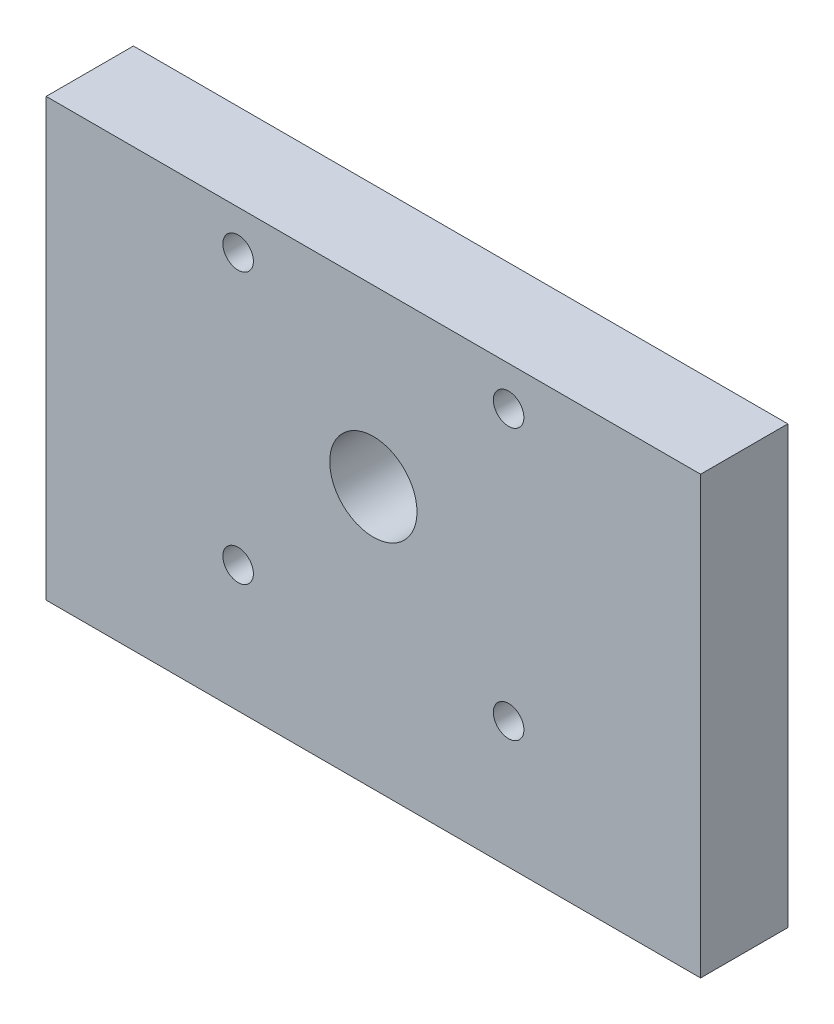
ISO-10303-21;
HEADER;
FILE_DESCRIPTION(('STEP AP214'),'2;1');
FILE_NAME('part.step','',(''),(''),'','','');
FILE_SCHEMA(('AUTOMOTIVE_DESIGN { 1 0 10303 214 1 1 1 1 }'));
ENDSEC;
DATA;
#1=APPLICATION_CONTEXT('core data for automotive mechanical design processes');
#2=APPLICATION_PROTOCOL_DEFINITION('international standard','automotive_design',2000,#1);
#3=PRODUCT_CONTEXT('',#1,'mechanical');
#4=PRODUCT('Part','Part','',(#3));
#5=PRODUCT_RELATED_PRODUCT_CATEGORY('part','',(#4));
#6=PRODUCT_DEFINITION_FORMATION('','',#4);
#7=PRODUCT_DEFINITION_CONTEXT('part definition',#1,'design');
#8=PRODUCT_DEFINITION('design','',#6,#7);
#9=PRODUCT_DEFINITION_SHAPE('','',#8);
#10=(LENGTH_UNIT() NAMED_UNIT(*) SI_UNIT(.MILLI.,.METRE.));
#11=(NAMED_UNIT(*) PLANE_ANGLE_UNIT() SI_UNIT($,.RADIAN.));
#12=(NAMED_UNIT(*) SI_UNIT($,.STERADIAN.) SOLID_ANGLE_UNIT());
#13=UNCERTAINTY_MEASURE_WITH_UNIT(LENGTH_MEASURE(1.E-05),#10,'distance_accuracy_value','');
#14=(GEOMETRIC_REPRESENTATION_CONTEXT(3) GLOBAL_UNCERTAINTY_ASSIGNED_CONTEXT((#13)) GLOBAL_UNIT_ASSIGNED_CONTEXT((#10,
#11,#12)) REPRESENTATION_CONTEXT('',''));
#15=CARTESIAN_POINT('',(0.,0.,0.));
#16=DIRECTION('',(0.,0.,1.));
#17=DIRECTION('',(1.,0.,0.));
#18=AXIS2_PLACEMENT_3D('',#15,#16,#17);
#19=CARTESIAN_POINT('',(0.,0.,10.));
#20=DIRECTION('',(0.,0.,-1.));
#21=DIRECTION('',(-1.,0.,0.));
#22=AXIS2_PLACEMENT_3D('',#19,#20,#21);
#23=PLANE('',#22);
#24=CARTESIAN_POINT('',(-15.5,15.4999999999998,10.));
#25=DIRECTION('',(0.,0.,-1.));
#26=DIRECTION('',(-1.,0.,0.));
#27=AXIS2_PLACEMENT_3D('',#24,#25,#26);
#28=CIRCLE('',#27,1.75);
#29=CARTESIAN_POINT('',(-17.25,15.4999999999998,10.));
#30=VERTEX_POINT('',#29);
#31=EDGE_CURVE('E109',#30,#30,#28,.T.);
#32=ORIENTED_EDGE('',*,*,#31,.T.);
#33=EDGE_LOOP('',(#32));
#34=FACE_BOUND('',#33,.T.);
#35=CARTESIAN_POINT('',(15.5,15.5000000000001,10.));
#36=DIRECTION('',(0.,0.,-1.));
#37=DIRECTION('',(-1.,0.,0.));
#38=AXIS2_PLACEMENT_3D('',#35,#36,#37);
#39=CIRCLE('',#38,1.75);
#40=CARTESIAN_POINT('',(13.75,15.5000000000001,10.));
#41=VERTEX_POINT('',#40);
#42=EDGE_CURVE('E115',#41,#41,#39,.T.);
#43=ORIENTED_EDGE('',*,*,#42,.T.);
#44=EDGE_LOOP('',(#43));
#45=FACE_BOUND('',#44,.T.);
#46=CARTESIAN_POINT('',(15.5000000000001,-15.4999999999999,10.));
#47=DIRECTION('',(0.,0.,-1.));
#48=DIRECTION('',(-1.,0.,0.));
#49=AXIS2_PLACEMENT_3D('',#46,#47,#48);
#50=CIRCLE('',#49,1.75);
#51=CARTESIAN_POINT('',(13.7500000000001,-15.4999999999999,10.));
#52=VERTEX_POINT('',#51);
#53=EDGE_CURVE('E121',#52,#52,#50,.T.);
#54=ORIENTED_EDGE('',*,*,#53,.T.);
#55=EDGE_LOOP('',(#54));
#56=FACE_BOUND('',#55,.T.);
#57=CARTESIAN_POINT('',(-15.4999999999999,-15.5,10.));
#58=DIRECTION('',(0.,0.,-1.));
#59=DIRECTION('',(-1.,0.,0.));
#60=AXIS2_PLACEMENT_3D('',#57,#58,#59);
#61=CIRCLE('',#60,1.75);
#62=CARTESIAN_POINT('',(-17.2499999999999,-15.5,10.));
#63=VERTEX_POINT('',#62);
#64=EDGE_CURVE('E127',#63,#63,#61,.T.);
#65=ORIENTED_EDGE('',*,*,#64,.T.);
#66=EDGE_LOOP('',(#65));
#67=FACE_BOUND('',#66,.T.);
#68=DIRECTION('',(0.,1.,0.));
#69=VECTOR('',#68,1.);
#70=CARTESIAN_POINT('',(37.5,-20.,10.));
#71=LINE('',#70,#69);
#72=CARTESIAN_POINT('',(37.5,-30.,10.));
#73=VERTEX_POINT('',#72);
#74=CARTESIAN_POINT('',(37.5,20.,10.));
#75=VERTEX_POINT('',#74);
#76=EDGE_CURVE('E87',#73,#75,#71,.T.);
#77=ORIENTED_EDGE('',*,*,#76,.T.);
#78=DIRECTION('',(-1.,0.,0.));
#79=VECTOR('',#78,1.);
#80=CARTESIAN_POINT('',(-37.5,20.,10.));
#81=LINE('',#80,#79);
#82=CARTESIAN_POINT('',(-37.5,20.,10.));
#83=VERTEX_POINT('',#82);
#84=EDGE_CURVE('E55',#75,#83,#81,.T.);
#85=ORIENTED_EDGE('',*,*,#84,.T.);
#86=DIRECTION('',(0.,-1.,0.));
#87=VECTOR('',#86,1.);
#88=CARTESIAN_POINT('',(-37.5,-20.,10.));
#89=LINE('',#88,#87);
#90=CARTESIAN_POINT('',(-37.5,-30.,10.));
#91=VERTEX_POINT('',#90);
#92=EDGE_CURVE('E70',#83,#91,#89,.T.);
#93=ORIENTED_EDGE('',*,*,#92,.T.);
#94=DIRECTION('',(-1.,0.,0.));
#95=VECTOR('',#94,1.);
#96=CARTESIAN_POINT('',(-37.5,-30.,10.));
#97=LINE('',#96,#95);
#98=EDGE_CURVE('E101',#73,#91,#97,.T.);
#99=ORIENTED_EDGE('',*,*,#98,.F.);
#100=EDGE_LOOP('',(#77,#85,#93,#99));
#101=FACE_BOUND('',#100,.T.);
#102=CARTESIAN_POINT('',(0.,0.,10.));
#103=DIRECTION('',(0.,0.,1.));
#104=DIRECTION('',(1.,0.,0.));
#105=AXIS2_PLACEMENT_3D('',#102,#103,#104);
#106=CIRCLE('',#105,5.);
#107=CARTESIAN_POINT('',(5.00000000000002,0.,10.));
#108=VERTEX_POINT('',#107);
#109=EDGE_CURVE('E131',#108,#108,#106,.T.);
#110=ORIENTED_EDGE('',*,*,#109,.F.);
#111=EDGE_LOOP('',(#110));
#112=FACE_BOUND('',#111,.T.);
#113=ADVANCED_FACE('F38',(#34,#45,#56,#67,#101,#112),#23,.F.);
#114=CARTESIAN_POINT('',(0.,0.,0.));
#115=DIRECTION('',(0.,0.,-1.));
#116=DIRECTION('',(-1.,0.,0.));
#117=AXIS2_PLACEMENT_3D('',#114,#115,#116);
#118=PLANE('',#117);
#119=CARTESIAN_POINT('',(-15.5,15.4999999999998,0.));
#120=DIRECTION('',(0.,0.,-1.));
#121=DIRECTION('',(-1.,0.,0.));
#122=AXIS2_PLACEMENT_3D('',#119,#120,#121);
#123=CIRCLE('',#122,1.75);
#124=CARTESIAN_POINT('',(-17.25,15.4999999999998,0.));
#125=VERTEX_POINT('',#124);
#126=EDGE_CURVE('E106',#125,#125,#123,.T.);
#127=ORIENTED_EDGE('',*,*,#126,.F.);
#128=EDGE_LOOP('',(#127));
#129=FACE_BOUND('',#128,.T.);
#130=CARTESIAN_POINT('',(15.5,15.5000000000001,0.));
#131=DIRECTION('',(0.,0.,-1.));
#132=DIRECTION('',(-1.,0.,0.));
#133=AXIS2_PLACEMENT_3D('',#130,#131,#132);
#134=CIRCLE('',#133,1.75);
#135=CARTESIAN_POINT('',(13.75,15.5000000000001,0.));
#136=VERTEX_POINT('',#135);
#137=EDGE_CURVE('E112',#136,#136,#134,.T.);
#138=ORIENTED_EDGE('',*,*,#137,.F.);
#139=EDGE_LOOP('',(#138));
#140=FACE_BOUND('',#139,.T.);
#141=CARTESIAN_POINT('',(15.5000000000001,-15.4999999999999,0.));
#142=DIRECTION('',(0.,0.,-1.));
#143=DIRECTION('',(-1.,0.,0.));
#144=AXIS2_PLACEMENT_3D('',#141,#142,#143);
#145=CIRCLE('',#144,1.75);
#146=CARTESIAN_POINT('',(13.7500000000001,-15.4999999999999,0.));
#147=VERTEX_POINT('',#146);
#148=EDGE_CURVE('E118',#147,#147,#145,.T.);
#149=ORIENTED_EDGE('',*,*,#148,.F.);
#150=EDGE_LOOP('',(#149));
#151=FACE_BOUND('',#150,.T.);
#152=CARTESIAN_POINT('',(-15.4999999999999,-15.5,0.));
#153=DIRECTION('',(0.,0.,-1.));
#154=DIRECTION('',(-1.,0.,0.));
#155=AXIS2_PLACEMENT_3D('',#152,#153,#154);
#156=CIRCLE('',#155,1.75);
#157=CARTESIAN_POINT('',(-17.2499999999999,-15.5,0.));
#158=VERTEX_POINT('',#157);
#159=EDGE_CURVE('E124',#158,#158,#156,.T.);
#160=ORIENTED_EDGE('',*,*,#159,.F.);
#161=EDGE_LOOP('',(#160));
#162=FACE_BOUND('',#161,.T.);
#163=DIRECTION('',(0.,1.,0.));
#164=VECTOR('',#163,1.);
#165=CARTESIAN_POINT('',(37.5,-20.,0.));
#166=LINE('',#165,#164);
#167=CARTESIAN_POINT('',(37.5,-30.,0.));
#168=VERTEX_POINT('',#167);
#169=CARTESIAN_POINT('',(37.5,20.,0.));
#170=VERTEX_POINT('',#169);
#171=EDGE_CURVE('E94',#168,#170,#166,.T.);
#172=ORIENTED_EDGE('',*,*,#171,.F.);
#173=DIRECTION('',(1.,0.,0.));
#174=VECTOR('',#173,1.);
#175=CARTESIAN_POINT('',(-37.5,-30.,0.));
#176=LINE('',#175,#174);
#177=CARTESIAN_POINT('',(-37.5,-30.,0.));
#178=VERTEX_POINT('',#177);
#179=EDGE_CURVE('E90',#178,#168,#176,.T.);
#180=ORIENTED_EDGE('',*,*,#179,.F.);
#181=DIRECTION('',(0.,-1.,0.));
#182=VECTOR('',#181,1.);
#183=CARTESIAN_POINT('',(-37.5,-20.,0.));
#184=LINE('',#183,#182);
#185=CARTESIAN_POINT('',(-37.5,20.,0.));
#186=VERTEX_POINT('',#185);
#187=EDGE_CURVE('E82',#186,#178,#184,.T.);
#188=ORIENTED_EDGE('',*,*,#187,.F.);
#189=DIRECTION('',(-1.,0.,0.));
#190=VECTOR('',#189,1.);
#191=CARTESIAN_POINT('',(-37.5,20.,0.));
#192=LINE('',#191,#190);
#193=EDGE_CURVE('E66',#170,#186,#192,.T.);
#194=ORIENTED_EDGE('',*,*,#193,.F.);
#195=EDGE_LOOP('',(#172,#180,#188,#194));
#196=FACE_BOUND('',#195,.T.);
#197=CARTESIAN_POINT('',(0.,0.,0.));
#198=DIRECTION('',(0.,0.,1.));
#199=DIRECTION('',(1.,0.,0.));
#200=AXIS2_PLACEMENT_3D('',#197,#198,#199);
#201=CIRCLE('',#200,5.);
#202=CARTESIAN_POINT('',(5.00000000000002,0.,0.));
#203=VERTEX_POINT('',#202);
#204=EDGE_CURVE('E130',#203,#203,#201,.T.);
#205=ORIENTED_EDGE('',*,*,#204,.T.);
#206=EDGE_LOOP('',(#205));
#207=FACE_BOUND('',#206,.T.);
#208=ADVANCED_FACE('F91',(#129,#140,#151,#162,#196,#207),#118,.T.);
#209=CARTESIAN_POINT('',(37.5,-20.,10.));
#210=DIRECTION('',(-1.,0.,0.));
#211=DIRECTION('',(0.,0.,1.));
#212=AXIS2_PLACEMENT_3D('',#209,#210,#211);
#213=PLANE('',#212);
#214=ORIENTED_EDGE('',*,*,#171,.T.);
#215=DIRECTION('',(0.,0.,-1.));
#216=VECTOR('',#215,1.);
#217=CARTESIAN_POINT('',(37.5,20.,10.));
#218=LINE('',#217,#216);
#219=EDGE_CURVE('E11',#75,#170,#218,.T.);
#220=ORIENTED_EDGE('',*,*,#219,.F.);
#221=ORIENTED_EDGE('',*,*,#76,.F.);
#222=DIRECTION('',(0.,0.,1.));
#223=VECTOR('',#222,1.);
#224=CARTESIAN_POINT('',(37.5,-30.,10.));
#225=LINE('',#224,#223);
#226=EDGE_CURVE('E98',#168,#73,#225,.T.);
#227=ORIENTED_EDGE('',*,*,#226,.F.);
#228=EDGE_LOOP('',(#214,#220,#221,#227));
#229=FACE_BOUND('',#228,.T.);
#230=ADVANCED_FACE('F40',(#229),#213,.F.);
#231=CARTESIAN_POINT('',(-37.5,20.,10.));
#232=DIRECTION('',(0.,-1.,0.));
#233=DIRECTION('',(0.,0.,-1.));
#234=AXIS2_PLACEMENT_3D('',#231,#232,#233);
#235=PLANE('',#234);
#236=ORIENTED_EDGE('',*,*,#193,.T.);
#237=DIRECTION('',(0.,0.,-1.));
#238=VECTOR('',#237,1.);
#239=CARTESIAN_POINT('',(-37.5,20.,10.));
#240=LINE('',#239,#238);
#241=EDGE_CURVE('E47',#83,#186,#240,.T.);
#242=ORIENTED_EDGE('',*,*,#241,.F.);
#243=ORIENTED_EDGE('',*,*,#84,.F.);
#244=ORIENTED_EDGE('',*,*,#219,.T.);
#245=EDGE_LOOP('',(#236,#242,#243,#244));
#246=FACE_BOUND('',#245,.T.);
#247=ADVANCED_FACE('F141',(#246),#235,.F.);
#248=CARTESIAN_POINT('',(-37.5,-20.,10.));
#249=DIRECTION('',(1.,0.,0.));
#250=DIRECTION('',(0.,0.,-1.));
#251=AXIS2_PLACEMENT_3D('',#248,#249,#250);
#252=PLANE('',#251);
#253=ORIENTED_EDGE('',*,*,#187,.T.);
#254=DIRECTION('',(0.,0.,-1.));
#255=VECTOR('',#254,1.);
#256=CARTESIAN_POINT('',(-37.5,-30.,10.));
#257=LINE('',#256,#255);
#258=EDGE_CURVE('E86',#91,#178,#257,.T.);
#259=ORIENTED_EDGE('',*,*,#258,.F.);
#260=ORIENTED_EDGE('',*,*,#92,.F.);
#261=ORIENTED_EDGE('',*,*,#241,.T.);
#262=EDGE_LOOP('',(#253,#259,#260,#261));
#263=FACE_BOUND('',#262,.T.);
#264=ADVANCED_FACE('F84',(#263),#252,.F.);
#265=CARTESIAN_POINT('',(0.,0.,10.));
#266=DIRECTION('',(0.,0.,-1.));
#267=DIRECTION('',(-1.,0.,0.));
#268=AXIS2_PLACEMENT_3D('',#265,#266,#267);
#269=CYLINDRICAL_SURFACE('',#268,5.);
#270=ORIENTED_EDGE('',*,*,#109,.T.);
#271=EDGE_LOOP('',(#270));
#272=FACE_BOUND('',#271,.T.);
#273=ORIENTED_EDGE('',*,*,#204,.F.);
#274=EDGE_LOOP('',(#273));
#275=FACE_BOUND('',#274,.T.);
#276=ADVANCED_FACE('F150',(#272,#275),#269,.F.);
#277=CARTESIAN_POINT('',(-15.4999999999999,-15.5,0.));
#278=DIRECTION('',(0.,0.,-1.));
#279=DIRECTION('',(-1.,0.,0.));
#280=AXIS2_PLACEMENT_3D('',#277,#278,#279);
#281=CYLINDRICAL_SURFACE('',#280,1.75);
#282=ORIENTED_EDGE('',*,*,#64,.F.);
#283=EDGE_LOOP('',(#282));
#284=FACE_BOUND('',#283,.T.);
#285=ORIENTED_EDGE('',*,*,#159,.T.);
#286=EDGE_LOOP('',(#285));
#287=FACE_BOUND('',#286,.T.);
#288=ADVANCED_FACE('F153',(#284,#287),#281,.F.);
#289=CARTESIAN_POINT('',(15.5000000000001,-15.4999999999999,0.));
#290=DIRECTION('',(0.,0.,-1.));
#291=DIRECTION('',(-1.,0.,0.));
#292=AXIS2_PLACEMENT_3D('',#289,#290,#291);
#293=CYLINDRICAL_SURFACE('',#292,1.75);
#294=ORIENTED_EDGE('',*,*,#53,.F.);
#295=EDGE_LOOP('',(#294));
#296=FACE_BOUND('',#295,.T.);
#297=ORIENTED_EDGE('',*,*,#148,.T.);
#298=EDGE_LOOP('',(#297));
#299=FACE_BOUND('',#298,.T.);
#300=ADVANCED_FACE('F224',(#296,#299),#293,.F.);
#301=CARTESIAN_POINT('',(15.5,15.5000000000001,0.));
#302=DIRECTION('',(0.,0.,-1.));
#303=DIRECTION('',(-1.,0.,0.));
#304=AXIS2_PLACEMENT_3D('',#301,#302,#303);
#305=CYLINDRICAL_SURFACE('',#304,1.75);
#306=ORIENTED_EDGE('',*,*,#42,.F.);
#307=EDGE_LOOP('',(#306));
#308=FACE_BOUND('',#307,.T.);
#309=ORIENTED_EDGE('',*,*,#137,.T.);
#310=EDGE_LOOP('',(#309));
#311=FACE_BOUND('',#310,.T.);
#312=ADVANCED_FACE('F219',(#308,#311),#305,.F.);
#313=CARTESIAN_POINT('',(-15.5,15.4999999999998,0.));
#314=DIRECTION('',(0.,0.,-1.));
#315=DIRECTION('',(-1.,0.,0.));
#316=AXIS2_PLACEMENT_3D('',#313,#314,#315);
#317=CYLINDRICAL_SURFACE('',#316,1.75);
#318=ORIENTED_EDGE('',*,*,#31,.F.);
#319=EDGE_LOOP('',(#318));
#320=FACE_BOUND('',#319,.T.);
#321=ORIENTED_EDGE('',*,*,#126,.T.);
#322=EDGE_LOOP('',(#321));
#323=FACE_BOUND('',#322,.T.);
#324=ADVANCED_FACE('F186',(#320,#323),#317,.F.);
#325=CARTESIAN_POINT('',(0.,-30.,0.));
#326=DIRECTION('',(0.,-1.,0.));
#327=DIRECTION('',(0.,0.,-1.));
#328=AXIS2_PLACEMENT_3D('',#325,#326,#327);
#329=PLANE('',#328);
#330=ORIENTED_EDGE('',*,*,#258,.T.);
#331=ORIENTED_EDGE('',*,*,#179,.T.);
#332=ORIENTED_EDGE('',*,*,#226,.T.);
#333=ORIENTED_EDGE('',*,*,#98,.T.);
#334=EDGE_LOOP('',(#330,#331,#332,#333));
#335=FACE_BOUND('',#334,.T.);
#336=ADVANCED_FACE('F100',(#335),#329,.T.);
#337=CLOSED_SHELL('',(#113,#208,#230,#247,#264,#276,#288,#300,#312,#324,#336));
#338=MANIFOLD_SOLID_BREP('B2',#337);
#339=ADVANCED_BREP_SHAPE_REPRESENTATION('',(#18,#338),#14);
#340=SHAPE_DEFINITION_REPRESENTATION(#9,#339);
ENDSEC;
END-ISO-10303-21;
